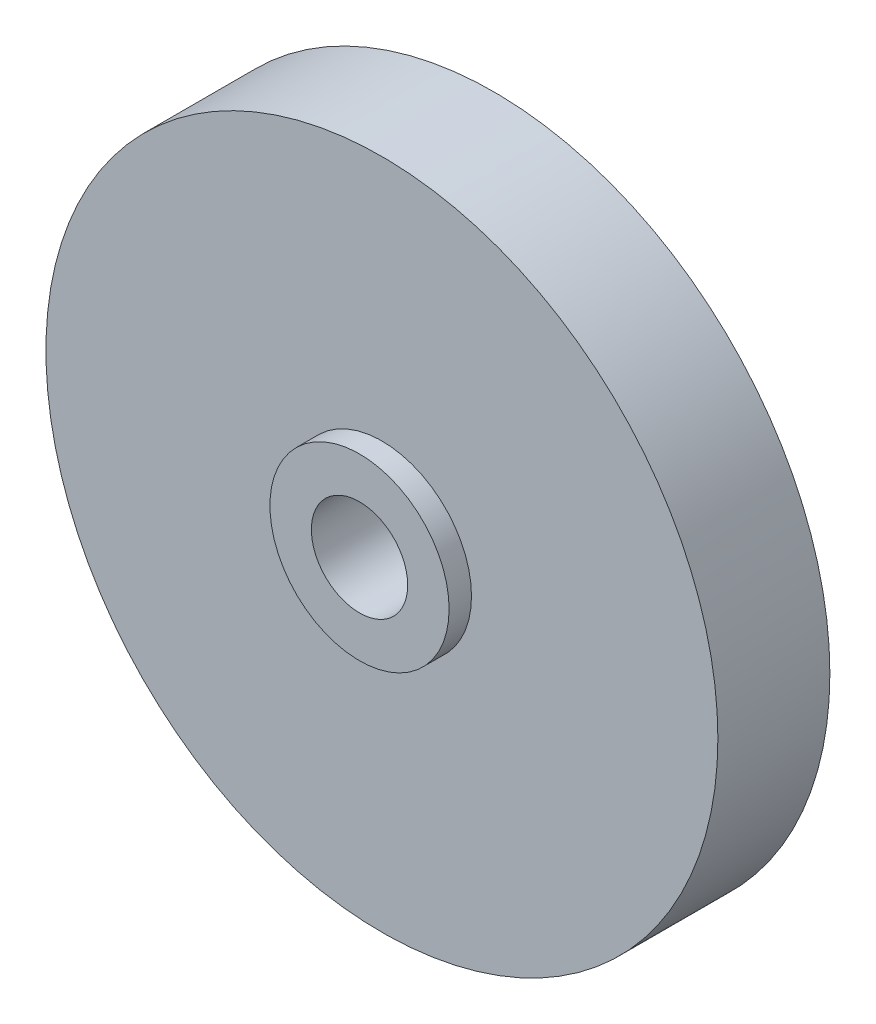
ISO-10303-21;
HEADER;
FILE_DESCRIPTION(('STEP AP214'),'2;1');
FILE_NAME('part.step','',(''),(''),'','','');
FILE_SCHEMA(('AUTOMOTIVE_DESIGN { 1 0 10303 214 1 1 1 1 }'));
ENDSEC;
DATA;
#1=APPLICATION_CONTEXT('core data for automotive mechanical design processes');
#2=APPLICATION_PROTOCOL_DEFINITION('international standard','automotive_design',2000,#1);
#3=PRODUCT_CONTEXT('',#1,'mechanical');
#4=PRODUCT('Part','Part','',(#3));
#5=PRODUCT_RELATED_PRODUCT_CATEGORY('part','',(#4));
#6=PRODUCT_DEFINITION_FORMATION('','',#4);
#7=PRODUCT_DEFINITION_CONTEXT('part definition',#1,'design');
#8=PRODUCT_DEFINITION('design','',#6,#7);
#9=PRODUCT_DEFINITION_SHAPE('','',#8);
#10=(LENGTH_UNIT() NAMED_UNIT(*) SI_UNIT(.MILLI.,.METRE.));
#11=(NAMED_UNIT(*) PLANE_ANGLE_UNIT() SI_UNIT($,.RADIAN.));
#12=(NAMED_UNIT(*) SI_UNIT($,.STERADIAN.) SOLID_ANGLE_UNIT());
#13=UNCERTAINTY_MEASURE_WITH_UNIT(LENGTH_MEASURE(1.E-05),#10,'distance_accuracy_value','');
#14=(GEOMETRIC_REPRESENTATION_CONTEXT(3) GLOBAL_UNCERTAINTY_ASSIGNED_CONTEXT((#13)) GLOBAL_UNIT_ASSIGNED_CONTEXT((#10,
#11,#12)) REPRESENTATION_CONTEXT('',''));
#15=CARTESIAN_POINT('',(0.,0.,0.));
#16=DIRECTION('',(0.,0.,1.));
#17=DIRECTION('',(1.,0.,0.));
#18=AXIS2_PLACEMENT_3D('',#15,#16,#17);
#19=CARTESIAN_POINT('',(0.,0.,12.));
#20=DIRECTION('',(0.,0.,1.));
#21=DIRECTION('',(1.,0.,0.));
#22=AXIS2_PLACEMENT_3D('',#19,#20,#21);
#23=PLANE('',#22);
#24=CARTESIAN_POINT('',(0.,0.,12.));
#25=DIRECTION('',(0.,0.,1.));
#26=DIRECTION('',(1.,0.,0.));
#27=AXIS2_PLACEMENT_3D('',#24,#25,#26);
#28=CIRCLE('',#27,4.3);
#29=CARTESIAN_POINT('',(4.3,0.,12.));
#30=VERTEX_POINT('',#29);
#31=EDGE_CURVE('E43',#30,#30,#28,.T.);
#32=ORIENTED_EDGE('',*,*,#31,.F.);
#33=EDGE_LOOP('',(#32));
#34=FACE_BOUND('',#33,.T.);
#35=CARTESIAN_POINT('',(0.,0.,12.));
#36=DIRECTION('',(0.,0.,1.));
#37=DIRECTION('',(1.,0.,0.));
#38=AXIS2_PLACEMENT_3D('',#35,#36,#37);
#39=CIRCLE('',#38,8.);
#40=CARTESIAN_POINT('',(8.,0.,12.));
#41=VERTEX_POINT('',#40);
#42=EDGE_CURVE('E59',#41,#41,#39,.T.);
#43=ORIENTED_EDGE('',*,*,#42,.T.);
#44=EDGE_LOOP('',(#43));
#45=FACE_BOUND('',#44,.T.);
#46=ADVANCED_FACE('F35',(#34,#45),#23,.T.);
#47=CARTESIAN_POINT('',(0.,0.,12.));
#48=DIRECTION('',(0.,0.,-1.));
#49=DIRECTION('',(-1.,0.,0.));
#50=AXIS2_PLACEMENT_3D('',#47,#48,#49);
#51=CYLINDRICAL_SURFACE('',#50,30.);
#52=CARTESIAN_POINT('',(0.,0.,0.));
#53=DIRECTION('',(0.,0.,1.));
#54=DIRECTION('',(1.,0.,0.));
#55=AXIS2_PLACEMENT_3D('',#52,#53,#54);
#56=CIRCLE('',#55,30.);
#57=CARTESIAN_POINT('',(30.,0.,0.));
#58=VERTEX_POINT('',#57);
#59=EDGE_CURVE('E10',#58,#58,#56,.T.);
#60=ORIENTED_EDGE('',*,*,#59,.T.);
#61=EDGE_LOOP('',(#60));
#62=FACE_BOUND('',#61,.T.);
#63=CARTESIAN_POINT('',(0.,0.,10.));
#64=DIRECTION('',(0.,0.,1.));
#65=DIRECTION('',(1.,0.,0.));
#66=AXIS2_PLACEMENT_3D('',#63,#64,#65);
#67=CIRCLE('',#66,30.);
#68=CARTESIAN_POINT('',(30.,0.,10.));
#69=VERTEX_POINT('',#68);
#70=EDGE_CURVE('E53',#69,#69,#67,.T.);
#71=ORIENTED_EDGE('',*,*,#70,.F.);
#72=EDGE_LOOP('',(#71));
#73=FACE_BOUND('',#72,.T.);
#74=ADVANCED_FACE('F37',(#62,#73),#51,.T.);
#75=CARTESIAN_POINT('',(0.,0.,0.));
#76=DIRECTION('',(0.,0.,1.));
#77=DIRECTION('',(1.,0.,0.));
#78=AXIS2_PLACEMENT_3D('',#75,#76,#77);
#79=PLANE('',#78);
#80=CARTESIAN_POINT('',(0.,0.,0.));
#81=DIRECTION('',(0.,0.,1.));
#82=DIRECTION('',(1.,0.,0.));
#83=AXIS2_PLACEMENT_3D('',#80,#81,#82);
#84=CIRCLE('',#83,7.25);
#85=CARTESIAN_POINT('',(7.25,0.,0.));
#86=VERTEX_POINT('',#85);
#87=EDGE_CURVE('E49',#86,#86,#84,.T.);
#88=ORIENTED_EDGE('',*,*,#87,.T.);
#89=EDGE_LOOP('',(#88));
#90=FACE_BOUND('',#89,.T.);
#91=ORIENTED_EDGE('',*,*,#59,.F.);
#92=EDGE_LOOP('',(#91));
#93=FACE_BOUND('',#92,.T.);
#94=ADVANCED_FACE('F76',(#90,#93),#79,.F.);
#95=CARTESIAN_POINT('',(0.,0.,12.));
#96=DIRECTION('',(0.,0.,-1.));
#97=DIRECTION('',(-1.,0.,0.));
#98=AXIS2_PLACEMENT_3D('',#95,#96,#97);
#99=CYLINDRICAL_SURFACE('',#98,4.3);
#100=CARTESIAN_POINT('',(0.,0.,5.));
#101=DIRECTION('',(0.,0.,1.));
#102=DIRECTION('',(1.,0.,0.));
#103=AXIS2_PLACEMENT_3D('',#100,#101,#102);
#104=CIRCLE('',#103,4.3);
#105=CARTESIAN_POINT('',(4.3,0.,5.));
#106=VERTEX_POINT('',#105);
#107=EDGE_CURVE('E39',#106,#106,#104,.T.);
#108=ORIENTED_EDGE('',*,*,#107,.F.);
#109=EDGE_LOOP('',(#108));
#110=FACE_BOUND('',#109,.T.);
#111=ORIENTED_EDGE('',*,*,#31,.T.);
#112=EDGE_LOOP('',(#111));
#113=FACE_BOUND('',#112,.T.);
#114=ADVANCED_FACE('F82',(#110,#113),#99,.F.);
#115=CARTESIAN_POINT('',(0.,0.,5.));
#116=DIRECTION('',(0.,0.,-1.));
#117=DIRECTION('',(-1.,0.,0.));
#118=AXIS2_PLACEMENT_3D('',#115,#116,#117);
#119=CYLINDRICAL_SURFACE('',#118,7.25);
#120=CARTESIAN_POINT('',(0.,0.,5.));
#121=DIRECTION('',(0.,0.,1.));
#122=DIRECTION('',(1.,0.,0.));
#123=AXIS2_PLACEMENT_3D('',#120,#121,#122);
#124=CIRCLE('',#123,7.25);
#125=CARTESIAN_POINT('',(7.25,0.,5.));
#126=VERTEX_POINT('',#125);
#127=EDGE_CURVE('E52',#126,#126,#124,.T.);
#128=ORIENTED_EDGE('',*,*,#127,.T.);
#129=EDGE_LOOP('',(#128));
#130=FACE_BOUND('',#129,.T.);
#131=ORIENTED_EDGE('',*,*,#87,.F.);
#132=EDGE_LOOP('',(#131));
#133=FACE_BOUND('',#132,.T.);
#134=ADVANCED_FACE('F94',(#130,#133),#119,.F.);
#135=CARTESIAN_POINT('',(0.,0.,5.));
#136=DIRECTION('',(0.,0.,1.));
#137=DIRECTION('',(1.,0.,0.));
#138=AXIS2_PLACEMENT_3D('',#135,#136,#137);
#139=PLANE('',#138);
#140=ORIENTED_EDGE('',*,*,#107,.T.);
#141=EDGE_LOOP('',(#140));
#142=FACE_BOUND('',#141,.T.);
#143=ORIENTED_EDGE('',*,*,#127,.F.);
#144=EDGE_LOOP('',(#143));
#145=FACE_BOUND('',#144,.T.);
#146=ADVANCED_FACE('F71',(#142,#145),#139,.F.);
#147=CARTESIAN_POINT('',(0.,0.,10.));
#148=DIRECTION('',(0.,0.,1.));
#149=DIRECTION('',(1.,0.,0.));
#150=AXIS2_PLACEMENT_3D('',#147,#148,#149);
#151=PLANE('',#150);
#152=CARTESIAN_POINT('',(0.,0.,10.));
#153=DIRECTION('',(0.,0.,1.));
#154=DIRECTION('',(1.,0.,0.));
#155=AXIS2_PLACEMENT_3D('',#152,#153,#154);
#156=CIRCLE('',#155,8.);
#157=CARTESIAN_POINT('',(8.,0.,10.));
#158=VERTEX_POINT('',#157);
#159=EDGE_CURVE('E58',#158,#158,#156,.T.);
#160=ORIENTED_EDGE('',*,*,#159,.F.);
#161=EDGE_LOOP('',(#160));
#162=FACE_BOUND('',#161,.T.);
#163=ORIENTED_EDGE('',*,*,#70,.T.);
#164=EDGE_LOOP('',(#163));
#165=FACE_BOUND('',#164,.T.);
#166=ADVANCED_FACE('F68',(#162,#165),#151,.T.);
#167=CARTESIAN_POINT('',(0.,0.,10.));
#168=DIRECTION('',(0.,0.,1.));
#169=DIRECTION('',(1.,0.,0.));
#170=AXIS2_PLACEMENT_3D('',#167,#168,#169);
#171=CYLINDRICAL_SURFACE('',#170,8.);
#172=ORIENTED_EDGE('',*,*,#159,.T.);
#173=EDGE_LOOP('',(#172));
#174=FACE_BOUND('',#173,.T.);
#175=ORIENTED_EDGE('',*,*,#42,.F.);
#176=EDGE_LOOP('',(#175));
#177=FACE_BOUND('',#176,.T.);
#178=ADVANCED_FACE('F65',(#174,#177),#171,.T.);
#179=CLOSED_SHELL('',(#46,#74,#94,#114,#134,#146,#166,#178));
#180=MANIFOLD_SOLID_BREP('B2',#179);
#181=ADVANCED_BREP_SHAPE_REPRESENTATION('',(#18,#180),#14);
#182=SHAPE_DEFINITION_REPRESENTATION(#9,#181);
ENDSEC;
END-ISO-10303-21;
